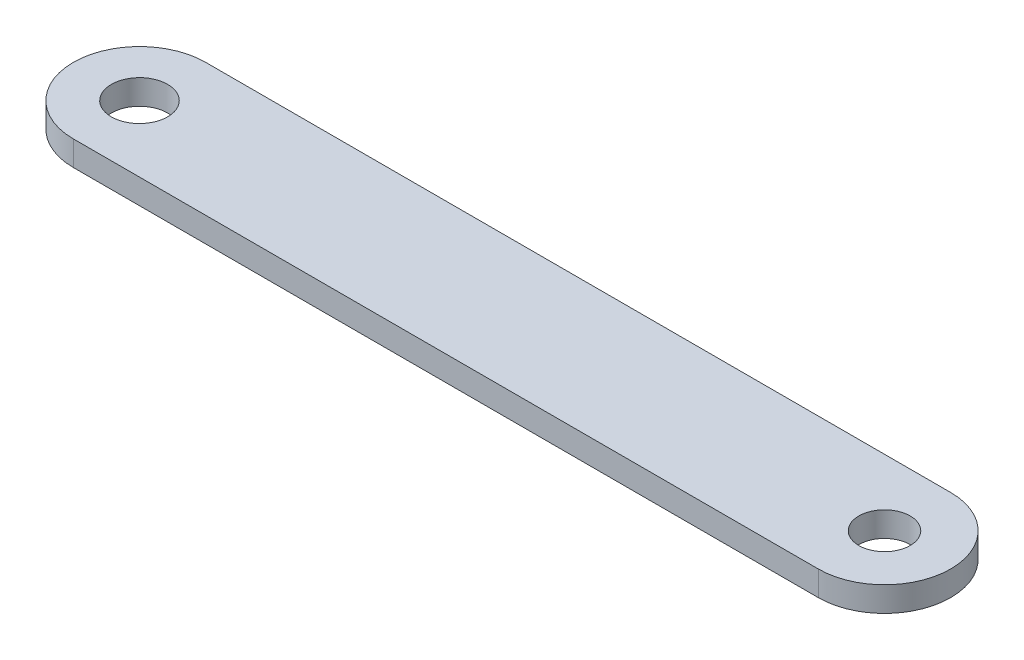
ISO-10303-21;
HEADER;
FILE_DESCRIPTION(('STEP AP214'),'2;1');
FILE_NAME('part.step','',(''),(''),'','','');
FILE_SCHEMA(('AUTOMOTIVE_DESIGN { 1 0 10303 214 1 1 1 1 }'));
ENDSEC;
DATA;
#1=APPLICATION_CONTEXT('core data for automotive mechanical design processes');
#2=APPLICATION_PROTOCOL_DEFINITION('international standard','automotive_design',2000,#1);
#3=PRODUCT_CONTEXT('',#1,'mechanical');
#4=PRODUCT('Part','Part','',(#3));
#5=PRODUCT_RELATED_PRODUCT_CATEGORY('part','',(#4));
#6=PRODUCT_DEFINITION_FORMATION('','',#4);
#7=PRODUCT_DEFINITION_CONTEXT('part definition',#1,'design');
#8=PRODUCT_DEFINITION('design','',#6,#7);
#9=PRODUCT_DEFINITION_SHAPE('','',#8);
#10=(LENGTH_UNIT() NAMED_UNIT(*) SI_UNIT(.MILLI.,.METRE.));
#11=(NAMED_UNIT(*) PLANE_ANGLE_UNIT() SI_UNIT($,.RADIAN.));
#12=(NAMED_UNIT(*) SI_UNIT($,.STERADIAN.) SOLID_ANGLE_UNIT());
#13=UNCERTAINTY_MEASURE_WITH_UNIT(LENGTH_MEASURE(1.E-05),#10,'distance_accuracy_value','');
#14=(GEOMETRIC_REPRESENTATION_CONTEXT(3) GLOBAL_UNCERTAINTY_ASSIGNED_CONTEXT((#13)) GLOBAL_UNIT_ASSIGNED_CONTEXT((#10,
#11,#12)) REPRESENTATION_CONTEXT('',''));
#15=CARTESIAN_POINT('',(0.,0.,0.));
#16=DIRECTION('',(0.,0.,1.));
#17=DIRECTION('',(1.,0.,0.));
#18=AXIS2_PLACEMENT_3D('',#15,#16,#17);
#19=CARTESIAN_POINT('',(0.,1.5,0.));
#20=DIRECTION('',(0.,-1.,0.));
#21=DIRECTION('',(0.,0.,-1.));
#22=AXIS2_PLACEMENT_3D('',#19,#20,#21);
#23=CYLINDRICAL_SURFACE('',#22,4.);
#24=CARTESIAN_POINT('',(0.,0.,0.));
#25=DIRECTION('',(0.,1.,0.));
#26=DIRECTION('',(0.,0.,1.));
#27=AXIS2_PLACEMENT_3D('',#24,#25,#26);
#28=CIRCLE('',#27,4.);
#29=CARTESIAN_POINT('',(0.,0.,-4.));
#30=VERTEX_POINT('',#29);
#31=CARTESIAN_POINT('',(0.,0.,4.));
#32=VERTEX_POINT('',#31);
#33=EDGE_CURVE('E96',#30,#32,#28,.T.);
#34=ORIENTED_EDGE('',*,*,#33,.T.);
#35=DIRECTION('',(0.,-1.,0.));
#36=VECTOR('',#35,1.);
#37=CARTESIAN_POINT('',(0.,1.5,4.));
#38=LINE('',#37,#36);
#39=CARTESIAN_POINT('',(0.,1.5,4.));
#40=VERTEX_POINT('',#39);
#41=EDGE_CURVE('E11',#40,#32,#38,.T.);
#42=ORIENTED_EDGE('',*,*,#41,.F.);
#43=CARTESIAN_POINT('',(0.,1.5,0.));
#44=DIRECTION('',(0.,1.,0.));
#45=DIRECTION('',(0.,0.,1.));
#46=AXIS2_PLACEMENT_3D('',#43,#44,#45);
#47=CIRCLE('',#46,4.);
#48=CARTESIAN_POINT('',(0.,1.5,-4.));
#49=VERTEX_POINT('',#48);
#50=EDGE_CURVE('E84',#49,#40,#47,.T.);
#51=ORIENTED_EDGE('',*,*,#50,.F.);
#52=DIRECTION('',(0.,-1.,0.));
#53=VECTOR('',#52,1.);
#54=CARTESIAN_POINT('',(0.,1.5,-4.));
#55=LINE('',#54,#53);
#56=EDGE_CURVE('E92',#49,#30,#55,.T.);
#57=ORIENTED_EDGE('',*,*,#56,.T.);
#58=EDGE_LOOP('',(#34,#42,#51,#57));
#59=FACE_BOUND('',#58,.T.);
#60=ADVANCED_FACE('F33',(#59),#23,.T.);
#61=CARTESIAN_POINT('',(0.,1.5,4.));
#62=DIRECTION('',(0.,0.,-1.));
#63=DIRECTION('',(-1.,0.,0.));
#64=AXIS2_PLACEMENT_3D('',#61,#62,#63);
#65=PLANE('',#64);
#66=DIRECTION('',(1.,0.,0.));
#67=VECTOR('',#66,1.);
#68=CARTESIAN_POINT('',(0.,0.,4.));
#69=LINE('',#68,#67);
#70=CARTESIAN_POINT('',(45.,0.,4.));
#71=VERTEX_POINT('',#70);
#72=EDGE_CURVE('E88',#32,#71,#69,.T.);
#73=ORIENTED_EDGE('',*,*,#72,.T.);
#74=DIRECTION('',(0.,-1.,0.));
#75=VECTOR('',#74,1.);
#76=CARTESIAN_POINT('',(45.,1.5,4.));
#77=LINE('',#76,#75);
#78=CARTESIAN_POINT('',(45.,1.5,4.));
#79=VERTEX_POINT('',#78);
#80=EDGE_CURVE('E41',#79,#71,#77,.T.);
#81=ORIENTED_EDGE('',*,*,#80,.F.);
#82=DIRECTION('',(1.,0.,0.));
#83=VECTOR('',#82,1.);
#84=CARTESIAN_POINT('',(0.,1.5,4.));
#85=LINE('',#84,#83);
#86=EDGE_CURVE('E79',#40,#79,#85,.T.);
#87=ORIENTED_EDGE('',*,*,#86,.F.);
#88=ORIENTED_EDGE('',*,*,#41,.T.);
#89=EDGE_LOOP('',(#73,#81,#87,#88));
#90=FACE_BOUND('',#89,.T.);
#91=ADVANCED_FACE('F87',(#90),#65,.F.);
#92=CARTESIAN_POINT('',(45.,1.5,0.));
#93=DIRECTION('',(0.,-1.,0.));
#94=DIRECTION('',(0.,0.,-1.));
#95=AXIS2_PLACEMENT_3D('',#92,#93,#94);
#96=CYLINDRICAL_SURFACE('',#95,4.);
#97=CARTESIAN_POINT('',(45.,0.,0.));
#98=DIRECTION('',(0.,1.,0.));
#99=DIRECTION('',(0.,0.,1.));
#100=AXIS2_PLACEMENT_3D('',#97,#98,#99);
#101=CIRCLE('',#100,4.);
#102=CARTESIAN_POINT('',(45.,0.,-4.));
#103=VERTEX_POINT('',#102);
#104=EDGE_CURVE('E66',#71,#103,#101,.T.);
#105=ORIENTED_EDGE('',*,*,#104,.T.);
#106=DIRECTION('',(0.,-1.,0.));
#107=VECTOR('',#106,1.);
#108=CARTESIAN_POINT('',(45.,1.5,-4.));
#109=LINE('',#108,#107);
#110=CARTESIAN_POINT('',(45.,1.5,-4.));
#111=VERTEX_POINT('',#110);
#112=EDGE_CURVE('E89',#111,#103,#109,.T.);
#113=ORIENTED_EDGE('',*,*,#112,.F.);
#114=CARTESIAN_POINT('',(45.,1.5,0.));
#115=DIRECTION('',(0.,1.,0.));
#116=DIRECTION('',(0.,0.,1.));
#117=AXIS2_PLACEMENT_3D('',#114,#115,#116);
#118=CIRCLE('',#117,4.);
#119=EDGE_CURVE('E82',#79,#111,#118,.T.);
#120=ORIENTED_EDGE('',*,*,#119,.F.);
#121=ORIENTED_EDGE('',*,*,#80,.T.);
#122=EDGE_LOOP('',(#105,#113,#120,#121));
#123=FACE_BOUND('',#122,.T.);
#124=ADVANCED_FACE('F90',(#123),#96,.T.);
#125=CARTESIAN_POINT('',(0.,1.5,-4.));
#126=DIRECTION('',(0.,0.,1.));
#127=DIRECTION('',(1.,0.,0.));
#128=AXIS2_PLACEMENT_3D('',#125,#126,#127);
#129=PLANE('',#128);
#130=DIRECTION('',(-1.,0.,0.));
#131=VECTOR('',#130,1.);
#132=CARTESIAN_POINT('',(0.,0.,-4.));
#133=LINE('',#132,#131);
#134=EDGE_CURVE('E72',#103,#30,#133,.T.);
#135=ORIENTED_EDGE('',*,*,#134,.T.);
#136=ORIENTED_EDGE('',*,*,#56,.F.);
#137=DIRECTION('',(-1.,0.,0.));
#138=VECTOR('',#137,1.);
#139=CARTESIAN_POINT('',(0.,1.5,-4.));
#140=LINE('',#139,#138);
#141=EDGE_CURVE('E49',#111,#49,#140,.T.);
#142=ORIENTED_EDGE('',*,*,#141,.F.);
#143=ORIENTED_EDGE('',*,*,#112,.T.);
#144=EDGE_LOOP('',(#135,#136,#142,#143));
#145=FACE_BOUND('',#144,.T.);
#146=ADVANCED_FACE('F104',(#145),#129,.F.);
#147=CARTESIAN_POINT('',(0.,1.5,0.));
#148=DIRECTION('',(0.,1.,0.));
#149=DIRECTION('',(0.,0.,1.));
#150=AXIS2_PLACEMENT_3D('',#147,#148,#149);
#151=PLANE('',#150);
#152=CARTESIAN_POINT('',(45.,1.5,0.));
#153=DIRECTION('',(0.,1.,0.));
#154=DIRECTION('',(0.,0.,1.));
#155=AXIS2_PLACEMENT_3D('',#152,#153,#154);
#156=CIRCLE('',#155,1.55);
#157=CARTESIAN_POINT('',(45.,1.5,1.55));
#158=VERTEX_POINT('',#157);
#159=EDGE_CURVE('E116',#158,#158,#156,.T.);
#160=ORIENTED_EDGE('',*,*,#159,.F.);
#161=EDGE_LOOP('',(#160));
#162=FACE_BOUND('',#161,.T.);
#163=CARTESIAN_POINT('',(0.,1.5,0.));
#164=DIRECTION('',(0.,1.,0.));
#165=DIRECTION('',(0.,0.,1.));
#166=AXIS2_PLACEMENT_3D('',#163,#164,#165);
#167=CIRCLE('',#166,1.69999999999999);
#168=CARTESIAN_POINT('',(0.,1.5,1.69999999999999));
#169=VERTEX_POINT('',#168);
#170=EDGE_CURVE('E112',#169,#169,#167,.T.);
#171=ORIENTED_EDGE('',*,*,#170,.F.);
#172=EDGE_LOOP('',(#171));
#173=FACE_BOUND('',#172,.T.);
#174=ORIENTED_EDGE('',*,*,#50,.T.);
#175=ORIENTED_EDGE('',*,*,#86,.T.);
#176=ORIENTED_EDGE('',*,*,#119,.T.);
#177=ORIENTED_EDGE('',*,*,#141,.T.);
#178=EDGE_LOOP('',(#174,#175,#176,#177));
#179=FACE_BOUND('',#178,.T.);
#180=ADVANCED_FACE('F80',(#162,#173,#179),#151,.T.);
#181=CARTESIAN_POINT('',(0.,0.,0.));
#182=DIRECTION('',(0.,1.,0.));
#183=DIRECTION('',(0.,0.,1.));
#184=AXIS2_PLACEMENT_3D('',#181,#182,#183);
#185=PLANE('',#184);
#186=CARTESIAN_POINT('',(45.,0.,0.));
#187=DIRECTION('',(0.,1.,0.));
#188=DIRECTION('',(0.,0.,1.));
#189=AXIS2_PLACEMENT_3D('',#186,#187,#188);
#190=CIRCLE('',#189,1.55);
#191=CARTESIAN_POINT('',(45.,0.,1.55));
#192=VERTEX_POINT('',#191);
#193=EDGE_CURVE('E115',#192,#192,#190,.T.);
#194=ORIENTED_EDGE('',*,*,#193,.T.);
#195=EDGE_LOOP('',(#194));
#196=FACE_BOUND('',#195,.T.);
#197=CARTESIAN_POINT('',(0.,0.,0.));
#198=DIRECTION('',(0.,1.,0.));
#199=DIRECTION('',(0.,0.,1.));
#200=AXIS2_PLACEMENT_3D('',#197,#198,#199);
#201=CIRCLE('',#200,1.7);
#202=CARTESIAN_POINT('',(0.,0.,1.7));
#203=VERTEX_POINT('',#202);
#204=EDGE_CURVE('E99',#203,#203,#201,.T.);
#205=ORIENTED_EDGE('',*,*,#204,.T.);
#206=EDGE_LOOP('',(#205));
#207=FACE_BOUND('',#206,.T.);
#208=ORIENTED_EDGE('',*,*,#33,.F.);
#209=ORIENTED_EDGE('',*,*,#134,.F.);
#210=ORIENTED_EDGE('',*,*,#104,.F.);
#211=ORIENTED_EDGE('',*,*,#72,.F.);
#212=EDGE_LOOP('',(#208,#209,#210,#211));
#213=FACE_BOUND('',#212,.T.);
#214=ADVANCED_FACE('F107',(#196,#207,#213),#185,.F.);
#215=CARTESIAN_POINT('',(0.,1.5,0.));
#216=DIRECTION('',(0.,1.,0.));
#217=DIRECTION('',(0.,0.,1.));
#218=AXIS2_PLACEMENT_3D('',#215,#216,#217);
#219=CYLINDRICAL_SURFACE('',#218,1.69999999999999);
#220=ORIENTED_EDGE('',*,*,#204,.F.);
#221=EDGE_LOOP('',(#220));
#222=FACE_BOUND('',#221,.T.);
#223=ORIENTED_EDGE('',*,*,#170,.T.);
#224=EDGE_LOOP('',(#223));
#225=FACE_BOUND('',#224,.T.);
#226=ADVANCED_FACE('F127',(#222,#225),#219,.F.);
#227=CARTESIAN_POINT('',(45.,0.,0.));
#228=DIRECTION('',(0.,1.,0.));
#229=DIRECTION('',(0.,0.,1.));
#230=AXIS2_PLACEMENT_3D('',#227,#228,#229);
#231=CYLINDRICAL_SURFACE('',#230,1.55);
#232=ORIENTED_EDGE('',*,*,#193,.F.);
#233=EDGE_LOOP('',(#232));
#234=FACE_BOUND('',#233,.T.);
#235=ORIENTED_EDGE('',*,*,#159,.T.);
#236=EDGE_LOOP('',(#235));
#237=FACE_BOUND('',#236,.T.);
#238=ADVANCED_FACE('F124',(#234,#237),#231,.F.);
#239=CLOSED_SHELL('',(#60,#91,#124,#146,#180,#214,#226,#238));
#240=MANIFOLD_SOLID_BREP('B2',#239);
#241=ADVANCED_BREP_SHAPE_REPRESENTATION('',(#18,#240),#14);
#242=SHAPE_DEFINITION_REPRESENTATION(#9,#241);
ENDSEC;
END-ISO-10303-21;
